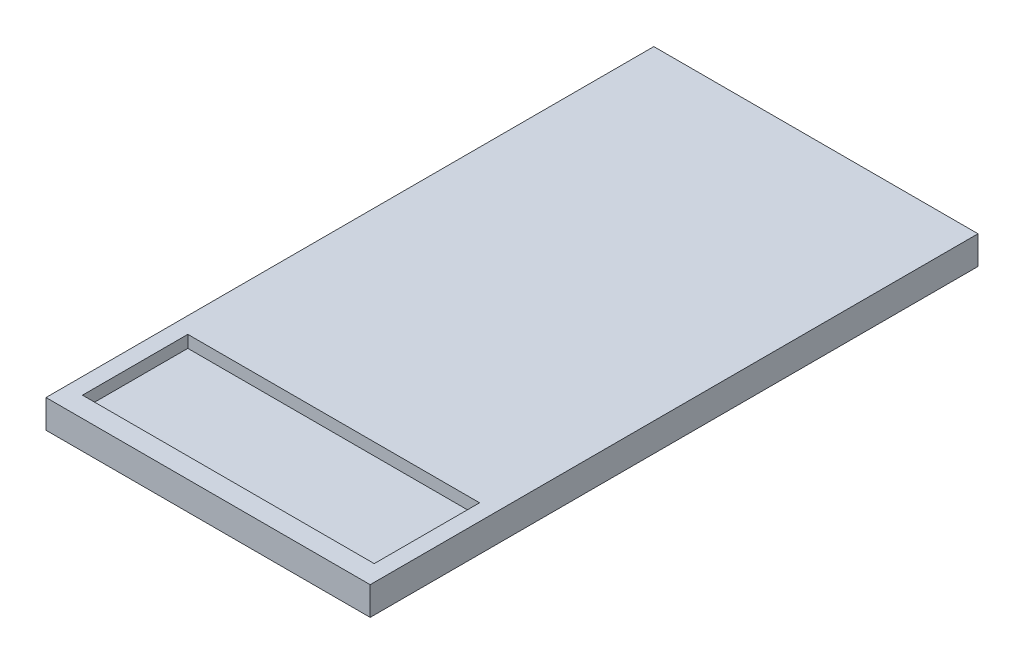
ISO-10303-21;
HEADER;
FILE_DESCRIPTION(('STEP AP214'),'2;1');
FILE_NAME('part.step','',(''),(''),'','','');
FILE_SCHEMA(('AUTOMOTIVE_DESIGN { 1 0 10303 214 1 1 1 1 }'));
ENDSEC;
DATA;
#1=APPLICATION_CONTEXT('core data for automotive mechanical design processes');
#2=APPLICATION_PROTOCOL_DEFINITION('international standard','automotive_design',2000,#1);
#3=PRODUCT_CONTEXT('',#1,'mechanical');
#4=PRODUCT('Part','Part','',(#3));
#5=PRODUCT_RELATED_PRODUCT_CATEGORY('part','',(#4));
#6=PRODUCT_DEFINITION_FORMATION('','',#4);
#7=PRODUCT_DEFINITION_CONTEXT('part definition',#1,'design');
#8=PRODUCT_DEFINITION('design','',#6,#7);
#9=PRODUCT_DEFINITION_SHAPE('','',#8);
#10=(LENGTH_UNIT() NAMED_UNIT(*) SI_UNIT(.MILLI.,.METRE.));
#11=(NAMED_UNIT(*) PLANE_ANGLE_UNIT() SI_UNIT($,.RADIAN.));
#12=(NAMED_UNIT(*) SI_UNIT($,.STERADIAN.) SOLID_ANGLE_UNIT());
#13=UNCERTAINTY_MEASURE_WITH_UNIT(LENGTH_MEASURE(1.E-05),#10,'distance_accuracy_value','');
#14=(GEOMETRIC_REPRESENTATION_CONTEXT(3) GLOBAL_UNCERTAINTY_ASSIGNED_CONTEXT((#13)) GLOBAL_UNIT_ASSIGNED_CONTEXT((#10,
#11,#12)) REPRESENTATION_CONTEXT('',''));
#15=CARTESIAN_POINT('',(0.,0.,0.));
#16=DIRECTION('',(0.,0.,1.));
#17=DIRECTION('',(1.,0.,0.));
#18=AXIS2_PLACEMENT_3D('',#15,#16,#17);
#19=CARTESIAN_POINT('',(-40.,-7.,-75.));
#20=DIRECTION('',(-1.,0.,0.));
#21=DIRECTION('',(0.,0.,1.));
#22=AXIS2_PLACEMENT_3D('',#19,#20,#21);
#23=PLANE('',#22);
#24=DIRECTION('',(0.,0.,1.));
#25=VECTOR('',#24,1.);
#26=CARTESIAN_POINT('',(-40.,0.,-75.));
#27=LINE('',#26,#25);
#28=CARTESIAN_POINT('',(-40.,0.,-75.));
#29=VERTEX_POINT('',#28);
#30=CARTESIAN_POINT('',(-40.,0.,75.));
#31=VERTEX_POINT('',#30);
#32=EDGE_CURVE('E139',#29,#31,#27,.T.);
#33=ORIENTED_EDGE('',*,*,#32,.F.);
#34=DIRECTION('',(0.,1.,0.));
#35=VECTOR('',#34,1.);
#36=CARTESIAN_POINT('',(-40.,-7.,-75.));
#37=LINE('',#36,#35);
#38=CARTESIAN_POINT('',(-40.,-7.,-75.));
#39=VERTEX_POINT('',#38);
#40=EDGE_CURVE('E11',#39,#29,#37,.T.);
#41=ORIENTED_EDGE('',*,*,#40,.F.);
#42=DIRECTION('',(0.,0.,1.));
#43=VECTOR('',#42,1.);
#44=CARTESIAN_POINT('',(-40.,-7.,-75.));
#45=LINE('',#44,#43);
#46=CARTESIAN_POINT('',(-40.,-7.,75.));
#47=VERTEX_POINT('',#46);
#48=EDGE_CURVE('E143',#39,#47,#45,.T.);
#49=ORIENTED_EDGE('',*,*,#48,.T.);
#50=DIRECTION('',(0.,1.,0.));
#51=VECTOR('',#50,1.);
#52=CARTESIAN_POINT('',(-40.,-7.,75.));
#53=LINE('',#52,#51);
#54=EDGE_CURVE('E35',#47,#31,#53,.T.);
#55=ORIENTED_EDGE('',*,*,#54,.T.);
#56=EDGE_LOOP('',(#33,#41,#49,#55));
#57=FACE_BOUND('',#56,.T.);
#58=ADVANCED_FACE('F32',(#57),#23,.T.);
#59=CARTESIAN_POINT('',(-40.,-7.,-75.));
#60=DIRECTION('',(0.,0.,-1.));
#61=DIRECTION('',(-1.,0.,0.));
#62=AXIS2_PLACEMENT_3D('',#59,#60,#61);
#63=PLANE('',#62);
#64=DIRECTION('',(-1.,0.,0.));
#65=VECTOR('',#64,1.);
#66=CARTESIAN_POINT('',(-40.,0.,-75.));
#67=LINE('',#66,#65);
#68=CARTESIAN_POINT('',(40.,0.,-75.));
#69=VERTEX_POINT('',#68);
#70=EDGE_CURVE('E146',#69,#29,#67,.T.);
#71=ORIENTED_EDGE('',*,*,#70,.F.);
#72=DIRECTION('',(0.,1.,0.));
#73=VECTOR('',#72,1.);
#74=CARTESIAN_POINT('',(40.,-7.,-75.));
#75=LINE('',#74,#73);
#76=CARTESIAN_POINT('',(40.,-7.,-75.));
#77=VERTEX_POINT('',#76);
#78=EDGE_CURVE('E40',#77,#69,#75,.T.);
#79=ORIENTED_EDGE('',*,*,#78,.F.);
#80=DIRECTION('',(-1.,0.,0.));
#81=VECTOR('',#80,1.);
#82=CARTESIAN_POINT('',(-40.,-7.,-75.));
#83=LINE('',#82,#81);
#84=EDGE_CURVE('E151',#77,#39,#83,.T.);
#85=ORIENTED_EDGE('',*,*,#84,.T.);
#86=ORIENTED_EDGE('',*,*,#40,.T.);
#87=EDGE_LOOP('',(#71,#79,#85,#86));
#88=FACE_BOUND('',#87,.T.);
#89=ADVANCED_FACE('F168',(#88),#63,.T.);
#90=CARTESIAN_POINT('',(40.,-7.,-75.));
#91=DIRECTION('',(1.,0.,0.));
#92=DIRECTION('',(0.,0.,-1.));
#93=AXIS2_PLACEMENT_3D('',#90,#91,#92);
#94=PLANE('',#93);
#95=DIRECTION('',(0.,0.,-1.));
#96=VECTOR('',#95,1.);
#97=CARTESIAN_POINT('',(40.,0.,-75.));
#98=LINE('',#97,#96);
#99=CARTESIAN_POINT('',(40.,0.,75.));
#100=VERTEX_POINT('',#99);
#101=EDGE_CURVE('E158',#100,#69,#98,.T.);
#102=ORIENTED_EDGE('',*,*,#101,.F.);
#103=DIRECTION('',(0.,1.,0.));
#104=VECTOR('',#103,1.);
#105=CARTESIAN_POINT('',(40.,-7.,75.));
#106=LINE('',#105,#104);
#107=CARTESIAN_POINT('',(40.,-7.,75.));
#108=VERTEX_POINT('',#107);
#109=EDGE_CURVE('E163',#108,#100,#106,.T.);
#110=ORIENTED_EDGE('',*,*,#109,.F.);
#111=DIRECTION('',(0.,0.,-1.));
#112=VECTOR('',#111,1.);
#113=CARTESIAN_POINT('',(40.,-7.,-75.));
#114=LINE('',#113,#112);
#115=EDGE_CURVE('E148',#108,#77,#114,.T.);
#116=ORIENTED_EDGE('',*,*,#115,.T.);
#117=ORIENTED_EDGE('',*,*,#78,.T.);
#118=EDGE_LOOP('',(#102,#110,#116,#117));
#119=FACE_BOUND('',#118,.T.);
#120=ADVANCED_FACE('F172',(#119),#94,.T.);
#121=CARTESIAN_POINT('',(-40.,-7.,75.));
#122=DIRECTION('',(0.,0.,1.));
#123=DIRECTION('',(1.,0.,0.));
#124=AXIS2_PLACEMENT_3D('',#121,#122,#123);
#125=PLANE('',#124);
#126=DIRECTION('',(1.,0.,0.));
#127=VECTOR('',#126,1.);
#128=CARTESIAN_POINT('',(-40.,0.,75.));
#129=LINE('',#128,#127);
#130=EDGE_CURVE('E155',#31,#100,#129,.T.);
#131=ORIENTED_EDGE('',*,*,#130,.F.);
#132=ORIENTED_EDGE('',*,*,#54,.F.);
#133=DIRECTION('',(1.,0.,0.));
#134=VECTOR('',#133,1.);
#135=CARTESIAN_POINT('',(-40.,-7.,75.));
#136=LINE('',#135,#134);
#137=EDGE_CURVE('E145',#47,#108,#136,.T.);
#138=ORIENTED_EDGE('',*,*,#137,.T.);
#139=ORIENTED_EDGE('',*,*,#109,.T.);
#140=EDGE_LOOP('',(#131,#132,#138,#139));
#141=FACE_BOUND('',#140,.T.);
#142=ADVANCED_FACE('F165',(#141),#125,.T.);
#143=CARTESIAN_POINT('',(-40.,-7.,75.));
#144=DIRECTION('',(0.,1.,0.));
#145=DIRECTION('',(0.,0.,1.));
#146=AXIS2_PLACEMENT_3D('',#143,#144,#145);
#147=PLANE('',#146);
#148=ORIENTED_EDGE('',*,*,#48,.F.);
#149=ORIENTED_EDGE('',*,*,#84,.F.);
#150=ORIENTED_EDGE('',*,*,#115,.F.);
#151=ORIENTED_EDGE('',*,*,#137,.F.);
#152=EDGE_LOOP('',(#148,#149,#150,#151));
#153=FACE_BOUND('',#152,.T.);
#154=ADVANCED_FACE('F174',(#153),#147,.F.);
#155=CARTESIAN_POINT('',(-40.,0.,75.));
#156=DIRECTION('',(0.,1.,0.));
#157=DIRECTION('',(0.,0.,1.));
#158=AXIS2_PLACEMENT_3D('',#155,#156,#157);
#159=PLANE('',#158);
#160=DIRECTION('',(0.,0.,1.));
#161=VECTOR('',#160,1.);
#162=CARTESIAN_POINT('',(-36.,0.,44.));
#163=LINE('',#162,#161);
#164=CARTESIAN_POINT('',(-36.,0.,44.));
#165=VERTEX_POINT('',#164);
#166=CARTESIAN_POINT('',(-36.,0.,70.));
#167=VERTEX_POINT('',#166);
#168=EDGE_CURVE('E48',#165,#167,#163,.T.);
#169=ORIENTED_EDGE('',*,*,#168,.F.);
#170=DIRECTION('',(-1.,0.,0.));
#171=VECTOR('',#170,1.);
#172=CARTESIAN_POINT('',(-36.,0.,44.));
#173=LINE('',#172,#171);
#174=CARTESIAN_POINT('',(36.,0.,44.));
#175=VERTEX_POINT('',#174);
#176=EDGE_CURVE('E124',#175,#165,#173,.T.);
#177=ORIENTED_EDGE('',*,*,#176,.F.);
#178=DIRECTION('',(0.,0.,-1.));
#179=VECTOR('',#178,1.);
#180=CARTESIAN_POINT('',(36.,0.,44.));
#181=LINE('',#180,#179);
#182=CARTESIAN_POINT('',(36.,0.,70.));
#183=VERTEX_POINT('',#182);
#184=EDGE_CURVE('E127',#183,#175,#181,.T.);
#185=ORIENTED_EDGE('',*,*,#184,.F.);
#186=DIRECTION('',(1.,0.,0.));
#187=VECTOR('',#186,1.);
#188=CARTESIAN_POINT('',(-36.,0.,70.));
#189=LINE('',#188,#187);
#190=EDGE_CURVE('E133',#167,#183,#189,.T.);
#191=ORIENTED_EDGE('',*,*,#190,.F.);
#192=EDGE_LOOP('',(#169,#177,#185,#191));
#193=FACE_BOUND('',#192,.T.);
#194=ORIENTED_EDGE('',*,*,#32,.T.);
#195=ORIENTED_EDGE('',*,*,#130,.T.);
#196=ORIENTED_EDGE('',*,*,#101,.T.);
#197=ORIENTED_EDGE('',*,*,#70,.T.);
#198=EDGE_LOOP('',(#194,#195,#196,#197));
#199=FACE_BOUND('',#198,.T.);
#200=ADVANCED_FACE('F167',(#193,#199),#159,.T.);
#201=CARTESIAN_POINT('',(-36.,-3.,44.));
#202=DIRECTION('',(-1.,0.,0.));
#203=DIRECTION('',(0.,0.,1.));
#204=AXIS2_PLACEMENT_3D('',#201,#202,#203);
#205=PLANE('',#204);
#206=ORIENTED_EDGE('',*,*,#168,.T.);
#207=DIRECTION('',(0.,1.,0.));
#208=VECTOR('',#207,1.);
#209=CARTESIAN_POINT('',(-36.,-3.,70.));
#210=LINE('',#209,#208);
#211=CARTESIAN_POINT('',(-36.,-3.,70.));
#212=VERTEX_POINT('',#211);
#213=EDGE_CURVE('E102',#212,#167,#210,.T.);
#214=ORIENTED_EDGE('',*,*,#213,.F.);
#215=DIRECTION('',(0.,0.,1.));
#216=VECTOR('',#215,1.);
#217=CARTESIAN_POINT('',(-36.,-3.,44.));
#218=LINE('',#217,#216);
#219=CARTESIAN_POINT('',(-36.,-3.,44.));
#220=VERTEX_POINT('',#219);
#221=EDGE_CURVE('E106',#220,#212,#218,.T.);
#222=ORIENTED_EDGE('',*,*,#221,.F.);
#223=DIRECTION('',(0.,1.,0.));
#224=VECTOR('',#223,1.);
#225=CARTESIAN_POINT('',(-36.,-3.,44.));
#226=LINE('',#225,#224);
#227=EDGE_CURVE('E137',#220,#165,#226,.T.);
#228=ORIENTED_EDGE('',*,*,#227,.T.);
#229=EDGE_LOOP('',(#206,#214,#222,#228));
#230=FACE_BOUND('',#229,.T.);
#231=ADVANCED_FACE('F104',(#230),#205,.F.);
#232=CARTESIAN_POINT('',(-36.,-3.,44.));
#233=DIRECTION('',(0.,0.,-1.));
#234=DIRECTION('',(-1.,0.,0.));
#235=AXIS2_PLACEMENT_3D('',#232,#233,#234);
#236=PLANE('',#235);
#237=ORIENTED_EDGE('',*,*,#176,.T.);
#238=ORIENTED_EDGE('',*,*,#227,.F.);
#239=DIRECTION('',(-1.,0.,0.));
#240=VECTOR('',#239,1.);
#241=CARTESIAN_POINT('',(-36.,-3.,44.));
#242=LINE('',#241,#240);
#243=CARTESIAN_POINT('',(36.,-3.,44.));
#244=VERTEX_POINT('',#243);
#245=EDGE_CURVE('E112',#244,#220,#242,.T.);
#246=ORIENTED_EDGE('',*,*,#245,.F.);
#247=DIRECTION('',(0.,1.,0.));
#248=VECTOR('',#247,1.);
#249=CARTESIAN_POINT('',(36.,-3.,44.));
#250=LINE('',#249,#248);
#251=EDGE_CURVE('E140',#244,#175,#250,.T.);
#252=ORIENTED_EDGE('',*,*,#251,.T.);
#253=EDGE_LOOP('',(#237,#238,#246,#252));
#254=FACE_BOUND('',#253,.T.);
#255=ADVANCED_FACE('F218',(#254),#236,.F.);
#256=CARTESIAN_POINT('',(36.,-3.,44.));
#257=DIRECTION('',(1.,0.,0.));
#258=DIRECTION('',(0.,0.,-1.));
#259=AXIS2_PLACEMENT_3D('',#256,#257,#258);
#260=PLANE('',#259);
#261=ORIENTED_EDGE('',*,*,#184,.T.);
#262=ORIENTED_EDGE('',*,*,#251,.F.);
#263=DIRECTION('',(0.,0.,-1.));
#264=VECTOR('',#263,1.);
#265=CARTESIAN_POINT('',(36.,-3.,44.));
#266=LINE('',#265,#264);
#267=CARTESIAN_POINT('',(36.,-3.,70.));
#268=VERTEX_POINT('',#267);
#269=EDGE_CURVE('E120',#268,#244,#266,.T.);
#270=ORIENTED_EDGE('',*,*,#269,.F.);
#271=DIRECTION('',(0.,1.,0.));
#272=VECTOR('',#271,1.);
#273=CARTESIAN_POINT('',(36.,-3.,70.));
#274=LINE('',#273,#272);
#275=EDGE_CURVE('E111',#268,#183,#274,.T.);
#276=ORIENTED_EDGE('',*,*,#275,.T.);
#277=EDGE_LOOP('',(#261,#262,#270,#276));
#278=FACE_BOUND('',#277,.T.);
#279=ADVANCED_FACE('F226',(#278),#260,.F.);
#280=CARTESIAN_POINT('',(-36.,-3.,70.));
#281=DIRECTION('',(0.,0.,1.));
#282=DIRECTION('',(1.,0.,0.));
#283=AXIS2_PLACEMENT_3D('',#280,#281,#282);
#284=PLANE('',#283);
#285=ORIENTED_EDGE('',*,*,#190,.T.);
#286=ORIENTED_EDGE('',*,*,#275,.F.);
#287=DIRECTION('',(1.,0.,0.));
#288=VECTOR('',#287,1.);
#289=CARTESIAN_POINT('',(-36.,-3.,70.));
#290=LINE('',#289,#288);
#291=EDGE_CURVE('E115',#212,#268,#290,.T.);
#292=ORIENTED_EDGE('',*,*,#291,.F.);
#293=ORIENTED_EDGE('',*,*,#213,.T.);
#294=EDGE_LOOP('',(#285,#286,#292,#293));
#295=FACE_BOUND('',#294,.T.);
#296=ADVANCED_FACE('F116',(#295),#284,.F.);
#297=CARTESIAN_POINT('',(-36.,-3.,70.));
#298=DIRECTION('',(0.,1.,0.));
#299=DIRECTION('',(0.,0.,1.));
#300=AXIS2_PLACEMENT_3D('',#297,#298,#299);
#301=PLANE('',#300);
#302=ORIENTED_EDGE('',*,*,#221,.T.);
#303=ORIENTED_EDGE('',*,*,#291,.T.);
#304=ORIENTED_EDGE('',*,*,#269,.T.);
#305=ORIENTED_EDGE('',*,*,#245,.T.);
#306=EDGE_LOOP('',(#302,#303,#304,#305));
#307=FACE_BOUND('',#306,.T.);
#308=ADVANCED_FACE('F122',(#307),#301,.T.);
#309=CLOSED_SHELL('',(#58,#89,#120,#142,#154,#200,#231,#255,#279,#296,#308));
#310=MANIFOLD_SOLID_BREP('B2',#309);
#311=ADVANCED_BREP_SHAPE_REPRESENTATION('',(#18,#310),#14);
#312=SHAPE_DEFINITION_REPRESENTATION(#9,#311);
ENDSEC;
END-ISO-10303-21;
